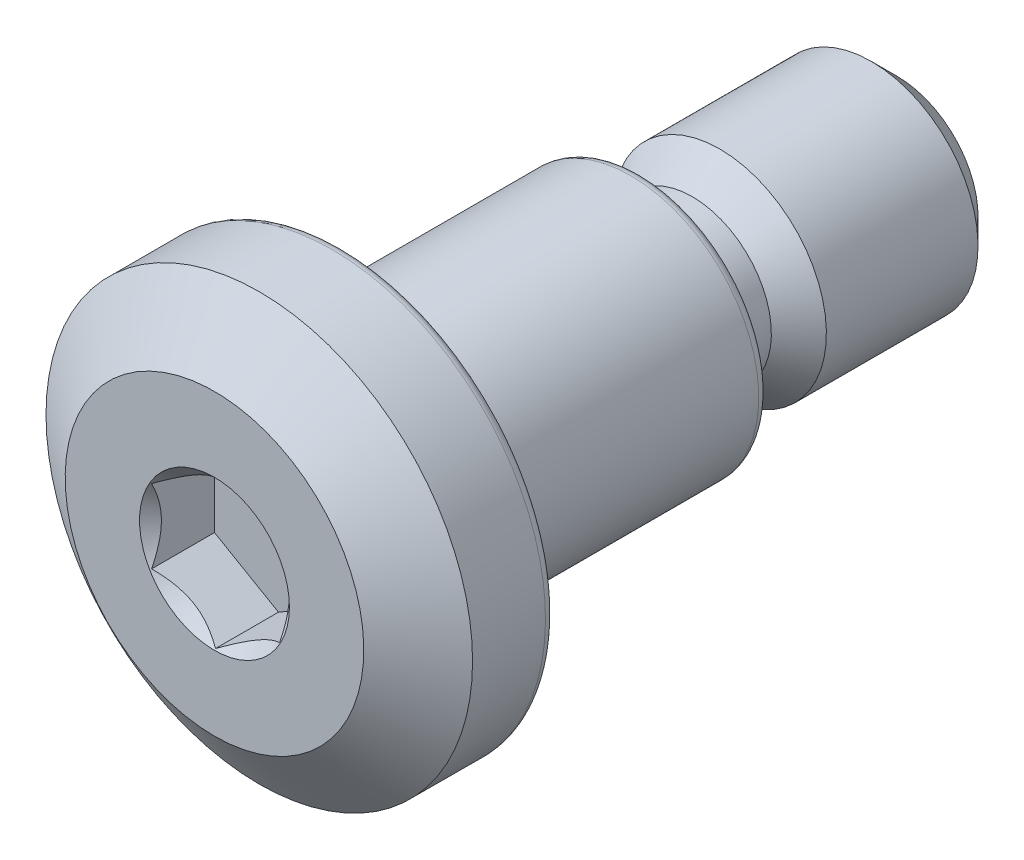
ISO-10303-21;
HEADER;
FILE_DESCRIPTION(('STEP AP214'),'2;1');
FILE_NAME('part.step','',(''),(''),'','','');
FILE_SCHEMA(('AUTOMOTIVE_DESIGN { 1 0 10303 214 1 1 1 1 }'));
ENDSEC;
DATA;
#1=APPLICATION_CONTEXT('core data for automotive mechanical design processes');
#2=APPLICATION_PROTOCOL_DEFINITION('international standard','automotive_design',2000,#1);
#3=PRODUCT_CONTEXT('',#1,'mechanical');
#4=PRODUCT('Part','Part','',(#3));
#5=PRODUCT_RELATED_PRODUCT_CATEGORY('part','',(#4));
#6=PRODUCT_DEFINITION_FORMATION('','',#4);
#7=PRODUCT_DEFINITION_CONTEXT('part definition',#1,'design');
#8=PRODUCT_DEFINITION('design','',#6,#7);
#9=PRODUCT_DEFINITION_SHAPE('','',#8);
#10=(LENGTH_UNIT() NAMED_UNIT(*) SI_UNIT(.MILLI.,.METRE.));
#11=(NAMED_UNIT(*) PLANE_ANGLE_UNIT() SI_UNIT($,.RADIAN.));
#12=(NAMED_UNIT(*) SI_UNIT($,.STERADIAN.) SOLID_ANGLE_UNIT());
#13=UNCERTAINTY_MEASURE_WITH_UNIT(LENGTH_MEASURE(1.E-05),#10,'distance_accuracy_value','');
#14=(GEOMETRIC_REPRESENTATION_CONTEXT(3) GLOBAL_UNCERTAINTY_ASSIGNED_CONTEXT((#13)) GLOBAL_UNIT_ASSIGNED_CONTEXT((#10,
#11,#12)) REPRESENTATION_CONTEXT('',''));
#15=CARTESIAN_POINT('',(0.,0.,0.));
#16=DIRECTION('',(0.,0.,1.));
#17=DIRECTION('',(1.,0.,0.));
#18=AXIS2_PLACEMENT_3D('',#15,#16,#17);
#19=CARTESIAN_POINT('',(0.,0.,-16.));
#20=DIRECTION('',(0.,0.,-1.));
#21=DIRECTION('',(0.,1.,0.));
#22=AXIS2_PLACEMENT_3D('',#19,#20,#21);
#23=CYLINDRICAL_SURFACE('',#22,3.);
#24=CARTESIAN_POINT('',(0.,0.,-3.48541019662497));
#25=DIRECTION('',(0.,0.,1.));
#26=DIRECTION('',(0.,-1.,0.));
#27=AXIS2_PLACEMENT_3D('',#24,#25,#26);
#28=CIRCLE('',#27,3.);
#29=CARTESIAN_POINT('',(0.,-3.,-3.48541019662497));
#30=VERTEX_POINT('',#29);
#31=EDGE_CURVE('E43',#30,#30,#28,.F.);
#32=ORIENTED_EDGE('',*,*,#31,.T.);
#33=EDGE_LOOP('',(#32));
#34=FACE_BOUND('',#33,.T.);
#35=CARTESIAN_POINT('',(0.,0.,-9.76000000000001));
#36=DIRECTION('',(0.,0.,-1.));
#37=DIRECTION('',(0.,1.,0.));
#38=AXIS2_PLACEMENT_3D('',#35,#36,#37);
#39=CIRCLE('',#38,3.);
#40=CARTESIAN_POINT('',(0.,3.,-9.76000000000001));
#41=VERTEX_POINT('',#40);
#42=EDGE_CURVE('E144',#41,#41,#39,.F.);
#43=ORIENTED_EDGE('',*,*,#42,.T.);
#44=EDGE_LOOP('',(#43));
#45=FACE_BOUND('',#44,.T.);
#46=ADVANCED_FACE('F35',(#34,#45),#23,.T.);
#47=CARTESIAN_POINT('',(0.,3.,-10.));
#48=DIRECTION('',(0.,0.,-1.));
#49=DIRECTION('',(0.,1.,0.));
#50=AXIS2_PLACEMENT_3D('',#47,#48,#49);
#51=PLANE('',#50);
#52=CARTESIAN_POINT('',(0.,0.,-10.));
#53=DIRECTION('',(0.,0.,-1.));
#54=DIRECTION('',(0.,1.,0.));
#55=AXIS2_PLACEMENT_3D('',#52,#53,#54);
#56=CIRCLE('',#55,2.76);
#57=CARTESIAN_POINT('',(0.,2.76,-10.));
#58=VERTEX_POINT('',#57);
#59=EDGE_CURVE('E141',#58,#58,#56,.T.);
#60=ORIENTED_EDGE('',*,*,#59,.T.);
#61=EDGE_LOOP('',(#60));
#62=FACE_BOUND('',#61,.T.);
#63=CARTESIAN_POINT('',(0.,0.,-10.));
#64=DIRECTION('',(0.,0.,-1.));
#65=DIRECTION('',(0.,1.,0.));
#66=AXIS2_PLACEMENT_3D('',#63,#64,#65);
#67=CIRCLE('',#66,2.50000000000001);
#68=CARTESIAN_POINT('',(0.,2.5,-10.));
#69=VERTEX_POINT('',#68);
#70=EDGE_CURVE('E123',#69,#69,#67,.T.);
#71=ORIENTED_EDGE('',*,*,#70,.F.);
#72=EDGE_LOOP('',(#71));
#73=FACE_BOUND('',#72,.T.);
#74=ADVANCED_FACE('F168',(#62,#73),#51,.T.);
#75=CARTESIAN_POINT('',(0.,0.,-10.645));
#76=DIRECTION('',(0.,0.,-1.));
#77=DIRECTION('',(0.,1.,0.));
#78=AXIS2_PLACEMENT_3D('',#75,#76,#77);
#79=TOROIDAL_SURFACE('',#78,2.50000000000001,0.645);
#80=CARTESIAN_POINT('',(0.,0.,-10.645));
#81=DIRECTION('',(0.,0.,-1.));
#82=DIRECTION('',(0.,1.,0.));
#83=AXIS2_PLACEMENT_3D('',#80,#81,#82);
#84=CIRCLE('',#83,1.855);
#85=CARTESIAN_POINT('',(0.,1.855,-10.645));
#86=VERTEX_POINT('',#85);
#87=EDGE_CURVE('E120',#86,#86,#84,.T.);
#88=ORIENTED_EDGE('',*,*,#87,.F.);
#89=EDGE_LOOP('',(#88));
#90=FACE_BOUND('',#89,.T.);
#91=ORIENTED_EDGE('',*,*,#70,.T.);
#92=EDGE_LOOP('',(#91));
#93=FACE_BOUND('',#92,.T.);
#94=ADVANCED_FACE('F173',(#90,#93),#79,.F.);
#95=CARTESIAN_POINT('',(0.,0.,-16.));
#96=DIRECTION('',(0.,0.,-1.));
#97=DIRECTION('',(0.,1.,0.));
#98=AXIS2_PLACEMENT_3D('',#95,#96,#97);
#99=CYLINDRICAL_SURFACE('',#98,1.855);
#100=CARTESIAN_POINT('',(0.,0.,-11.2));
#101=DIRECTION('',(0.,0.,-1.));
#102=DIRECTION('',(0.,1.,0.));
#103=AXIS2_PLACEMENT_3D('',#100,#101,#102);
#104=CIRCLE('',#103,1.855);
#105=CARTESIAN_POINT('',(0.,1.855,-11.2));
#106=VERTEX_POINT('',#105);
#107=EDGE_CURVE('E117',#106,#106,#104,.T.);
#108=ORIENTED_EDGE('',*,*,#107,.F.);
#109=EDGE_LOOP('',(#108));
#110=FACE_BOUND('',#109,.T.);
#111=ORIENTED_EDGE('',*,*,#87,.T.);
#112=EDGE_LOOP('',(#111));
#113=FACE_BOUND('',#112,.T.);
#114=ADVANCED_FACE('F342',(#110,#113),#99,.T.);
#115=CARTESIAN_POINT('',(0.,0.,-11.2));
#116=DIRECTION('',(0.,0.,-1.));
#117=DIRECTION('',(0.,1.,0.));
#118=AXIS2_PLACEMENT_3D('',#115,#116,#117);
#119=CONICAL_SURFACE('',#118,1.855,0.785398163397443);
#120=CARTESIAN_POINT('',(0.,0.,-11.845));
#121=DIRECTION('',(0.,0.,-1.));
#122=DIRECTION('',(0.,1.,0.));
#123=AXIS2_PLACEMENT_3D('',#120,#121,#122);
#124=CIRCLE('',#123,2.50000000000001);
#125=CARTESIAN_POINT('',(0.,2.5,-11.845));
#126=VERTEX_POINT('',#125);
#127=EDGE_CURVE('E126',#126,#126,#124,.F.);
#128=ORIENTED_EDGE('',*,*,#127,.T.);
#129=EDGE_LOOP('',(#128));
#130=FACE_BOUND('',#129,.T.);
#131=ORIENTED_EDGE('',*,*,#107,.T.);
#132=EDGE_LOOP('',(#131));
#133=FACE_BOUND('',#132,.T.);
#134=ADVANCED_FACE('F333',(#130,#133),#119,.T.);
#135=CARTESIAN_POINT('',(0.,2.5,-16.));
#136=DIRECTION('',(0.,0.,-1.));
#137=DIRECTION('',(0.,1.,0.));
#138=AXIS2_PLACEMENT_3D('',#135,#136,#137);
#139=PLANE('',#138);
#140=CARTESIAN_POINT('',(0.,0.,-16.));
#141=DIRECTION('',(0.,0.,-1.));
#142=DIRECTION('',(0.,1.,0.));
#143=AXIS2_PLACEMENT_3D('',#140,#141,#142);
#144=CIRCLE('',#143,1.9);
#145=CARTESIAN_POINT('',(0.,1.9,-16.));
#146=VERTEX_POINT('',#145);
#147=EDGE_CURVE('E129',#146,#146,#144,.T.);
#148=ORIENTED_EDGE('',*,*,#147,.T.);
#149=EDGE_LOOP('',(#148));
#150=FACE_BOUND('',#149,.T.);
#151=ADVANCED_FACE('F326',(#150),#139,.T.);
#152=CARTESIAN_POINT('',(0.,0.,-16.));
#153=DIRECTION('',(0.,0.,-1.));
#154=DIRECTION('',(0.,1.,0.));
#155=AXIS2_PLACEMENT_3D('',#152,#153,#154);
#156=CYLINDRICAL_SURFACE('',#155,2.50000000000001);
#157=CARTESIAN_POINT('',(0.,0.,-15.4));
#158=DIRECTION('',(0.,0.,-1.));
#159=DIRECTION('',(0.,1.,0.));
#160=AXIS2_PLACEMENT_3D('',#157,#158,#159);
#161=CIRCLE('',#160,2.50000000000001);
#162=CARTESIAN_POINT('',(0.,2.5,-15.4));
#163=VERTEX_POINT('',#162);
#164=EDGE_CURVE('E132',#163,#163,#161,.F.);
#165=ORIENTED_EDGE('',*,*,#164,.T.);
#166=EDGE_LOOP('',(#165));
#167=FACE_BOUND('',#166,.T.);
#168=ORIENTED_EDGE('',*,*,#127,.F.);
#169=EDGE_LOOP('',(#168));
#170=FACE_BOUND('',#169,.T.);
#171=ADVANCED_FACE('F182',(#167,#170),#156,.T.);
#172=CARTESIAN_POINT('',(0.,0.,-16.));
#173=DIRECTION('',(0.,0.,1.));
#174=DIRECTION('',(0.,-1.,0.));
#175=AXIS2_PLACEMENT_3D('',#172,#173,#174);
#176=CONICAL_SURFACE('',#175,1.9,0.785398163397443);
#177=ORIENTED_EDGE('',*,*,#164,.F.);
#178=EDGE_LOOP('',(#177));
#179=FACE_BOUND('',#178,.T.);
#180=ORIENTED_EDGE('',*,*,#147,.F.);
#181=EDGE_LOOP('',(#180));
#182=FACE_BOUND('',#181,.T.);
#183=ADVANCED_FACE('F178',(#179,#182),#176,.T.);
#184=CARTESIAN_POINT('',(0.,0.,-9.76000000000001));
#185=DIRECTION('',(0.,0.,-1.));
#186=DIRECTION('',(0.,1.,0.));
#187=AXIS2_PLACEMENT_3D('',#184,#185,#186);
#188=TOROIDAL_SURFACE('',#187,2.76,0.24);
#189=ORIENTED_EDGE('',*,*,#42,.F.);
#190=EDGE_LOOP('',(#189));
#191=FACE_BOUND('',#190,.T.);
#192=ORIENTED_EDGE('',*,*,#59,.F.);
#193=EDGE_LOOP('',(#192));
#194=FACE_BOUND('',#193,.T.);
#195=ADVANCED_FACE('F181',(#191,#194),#188,.T.);
#196=CARTESIAN_POINT('',(0.,0.,-3.15));
#197=DIRECTION('',(0.,0.,1.));
#198=DIRECTION('',(1.,0.,0.));
#199=AXIS2_PLACEMENT_3D('',#196,#197,#198);
#200=TOROIDAL_SURFACE('',#199,3.,0.15);
#201=CARTESIAN_POINT('',(0.,0.,-3.26180339887499));
#202=DIRECTION('',(0.,0.,1.));
#203=DIRECTION('',(0.,-1.,0.));
#204=AXIS2_PLACEMENT_3D('',#201,#202,#203);
#205=CIRCLE('',#204,2.9);
#206=CARTESIAN_POINT('',(0.,-2.9,-3.26180339887499));
#207=VERTEX_POINT('',#206);
#208=EDGE_CURVE('E11',#207,#207,#205,.T.);
#209=ORIENTED_EDGE('',*,*,#208,.T.);
#210=EDGE_LOOP('',(#209));
#211=FACE_BOUND('',#210,.T.);
#212=CARTESIAN_POINT('',(0.,0.,-3.));
#213=DIRECTION('',(0.,0.,1.));
#214=DIRECTION('',(1.,0.,0.));
#215=AXIS2_PLACEMENT_3D('',#212,#213,#214);
#216=CIRCLE('',#215,3.);
#217=CARTESIAN_POINT('',(3.,0.,-3.));
#218=VERTEX_POINT('',#217);
#219=EDGE_CURVE('E206',#218,#218,#216,.F.);
#220=ORIENTED_EDGE('',*,*,#219,.T.);
#221=EDGE_LOOP('',(#220));
#222=FACE_BOUND('',#221,.T.);
#223=ADVANCED_FACE('F191',(#211,#222),#200,.F.);
#224=CARTESIAN_POINT('',(0.,0.,-1.5));
#225=DIRECTION('',(0.,0.,1.));
#226=DIRECTION('',(1.,0.,0.));
#227=AXIS2_PLACEMENT_3D('',#224,#225,#226);
#228=PLANE('',#227);
#229=DIRECTION('',(-0.866025403784439,0.499999999999999,0.));
#230=VECTOR('',#229,1.);
#231=CARTESIAN_POINT('',(1.5,0.866025403784439,-1.5));
#232=LINE('',#231,#230);
#233=CARTESIAN_POINT('',(1.5,0.866025403784439,-1.5));
#234=VERTEX_POINT('',#233);
#235=CARTESIAN_POINT('',(0.,1.73205080756888,-1.5));
#236=VERTEX_POINT('',#235);
#237=EDGE_CURVE('E100',#234,#236,#232,.T.);
#238=ORIENTED_EDGE('',*,*,#237,.T.);
#239=DIRECTION('',(-0.866025403784438,-0.500000000000001,0.));
#240=VECTOR('',#239,1.);
#241=CARTESIAN_POINT('',(0.,1.73205080756888,-1.5));
#242=LINE('',#241,#240);
#243=CARTESIAN_POINT('',(-1.5,0.866025403784438,-1.5));
#244=VERTEX_POINT('',#243);
#245=EDGE_CURVE('E105',#236,#244,#242,.T.);
#246=ORIENTED_EDGE('',*,*,#245,.T.);
#247=DIRECTION('',(0.,-1.,0.));
#248=VECTOR('',#247,1.);
#249=CARTESIAN_POINT('',(-1.5,0.866025403784438,-1.5));
#250=LINE('',#249,#248);
#251=CARTESIAN_POINT('',(-1.5,-0.866025403784438,-1.5));
#252=VERTEX_POINT('',#251);
#253=EDGE_CURVE('E282',#244,#252,#250,.T.);
#254=ORIENTED_EDGE('',*,*,#253,.T.);
#255=DIRECTION('',(0.866025403784439,-0.5,0.));
#256=VECTOR('',#255,1.);
#257=CARTESIAN_POINT('',(-1.5,-0.866025403784438,-1.5));
#258=LINE('',#257,#256);
#259=CARTESIAN_POINT('',(0.,-1.73205080756888,-1.5));
#260=VERTEX_POINT('',#259);
#261=EDGE_CURVE('E286',#252,#260,#258,.T.);
#262=ORIENTED_EDGE('',*,*,#261,.T.);
#263=DIRECTION('',(0.866025403784438,0.5,0.));
#264=VECTOR('',#263,1.);
#265=CARTESIAN_POINT('',(0.,-1.73205080756888,-1.5));
#266=LINE('',#265,#264);
#267=CARTESIAN_POINT('',(1.5,-0.866025403784438,-1.5));
#268=VERTEX_POINT('',#267);
#269=EDGE_CURVE('E113',#260,#268,#266,.T.);
#270=ORIENTED_EDGE('',*,*,#269,.T.);
#271=DIRECTION('',(0.,1.,0.));
#272=VECTOR('',#271,1.);
#273=CARTESIAN_POINT('',(1.5,-0.866025403784438,-1.5));
#274=LINE('',#273,#272);
#275=EDGE_CURVE('E108',#268,#234,#274,.T.);
#276=ORIENTED_EDGE('',*,*,#275,.T.);
#277=EDGE_LOOP('',(#238,#246,#254,#262,#270,#276));
#278=FACE_BOUND('',#277,.T.);
#279=ADVANCED_FACE('F232',(#278),#228,.T.);
#280=CARTESIAN_POINT('',(1.5,0.866025403784439,-1.5));
#281=DIRECTION('',(0.499999999999999,0.866025403784439,0.));
#282=DIRECTION('',(-0.866025403784439,0.499999999999999,0.));
#283=AXIS2_PLACEMENT_3D('',#280,#281,#282);
#284=PLANE('',#283);
#285=DIRECTION('',(0.,0.,1.));
#286=VECTOR('',#285,1.);
#287=CARTESIAN_POINT('',(1.5,0.866025403784439,-1.5));
#288=LINE('',#287,#286);
#289=CARTESIAN_POINT('',(1.5,0.86602540378444,-0.0250000000000002));
#290=VERTEX_POINT('',#289);
#291=EDGE_CURVE('E58',#234,#290,#288,.T.);
#292=ORIENTED_EDGE('',*,*,#291,.T.);
#293=CARTESIAN_POINT('',(1.5002,0.865909933730602,-0.0248845183999266));
#294=CARTESIAN_POINT('',(1.44863220926292,0.895682611594167,-0.0546345239326721));
#295=CARTESIAN_POINT('',(1.3962020823348,0.925953159489766,-0.0826375160896872));
#296=CARTESIAN_POINT('',(1.2892909659444,0.987678321317124,-0.133910769559857));
#297=CARTESIAN_POINT('',(1.23479980418534,1.01913880822718,-0.157152494955627));
#298=CARTESIAN_POINT('',(1.12492091864275,1.08257741237344,-0.19696627100778));
#299=CARTESIAN_POINT('',(1.0695611909048,1.11453936608521,-0.213638414329104));
#300=CARTESIAN_POINT('',(0.957622742522848,1.1791670593912,-0.239325543181897));
#301=CARTESIAN_POINT('',(0.90104744344699,1.21183082354213,-0.248359709521134));
#302=CARTESIAN_POINT('',(0.803544610483558,1.26812411040032,-0.256510918773148));
#303=CARTESIAN_POINT('',(0.762743091719533,1.29168087824208,-0.257717747010784));
#304=CARTESIAN_POINT('',(0.681212030384141,1.33875285845138,-0.255685942837733));
#305=CARTESIAN_POINT('',(0.640482505685369,1.36226806050018,-0.252446329251693));
#306=CARTESIAN_POINT('',(0.559415597836583,1.40907206156905,-0.241708014018038));
#307=CARTESIAN_POINT('',(0.519078615401711,1.43236062923612,-0.234205346981267));
#308=CARTESIAN_POINT('',(0.439081663085968,1.47854689118996,-0.21534838807171));
#309=CARTESIAN_POINT('',(0.399421991483791,1.50144441326545,-0.203992442981415));
#310=CARTESIAN_POINT('',(0.297836865225514,1.56009461325633,-0.170278352407329));
#311=CARTESIAN_POINT('',(0.236541446290309,1.59548353987866,-0.145378150906633));
#312=CARTESIAN_POINT('',(0.146414371536685,1.64751843074894,-0.103343346728424));
#313=CARTESIAN_POINT('',(0.116714860092281,1.66466545167617,-0.088574846440904));
#314=CARTESIAN_POINT('',(0.0578620986162473,1.69864410935691,-0.0576894340598313));
#315=CARTESIAN_POINT('',(0.028708595779361,1.71547589206761,-0.0415731658782895));
#316=CARTESIAN_POINT('',(-0.000200000000001772,1.73216627762271,-0.0248845183999265));
#317=B_SPLINE_CURVE_WITH_KNOTS('',3,(#293,#294,#295,#296,#297,#298,#299,#300,#301,#302,#303,
#304,#305,#306,#307,#308,#309,#310,#311,#312,#313,#314,#315,#316),.UNSPECIFIED.,.F.,.F.,(4,2,2,
2,2,2,2,2,2,2,2,4),(0.,0.199829143693304,0.400822987382389,0.598623720538181,0.795926240188889,
0.937113067959881,1.07833105577193,1.21968061668222,1.36109089931054,1.58570969637565,
1.69770705470964,1.80965120737194),.UNSPECIFIED.);
#318=CARTESIAN_POINT('',(0.,1.73205080756888,-0.025));
#319=VERTEX_POINT('',#318);
#320=EDGE_CURVE('E90',#290,#319,#317,.T.);
#321=ORIENTED_EDGE('',*,*,#320,.T.);
#322=DIRECTION('',(0.,0.,1.));
#323=VECTOR('',#322,1.);
#324=CARTESIAN_POINT('',(0.,1.73205080756888,-1.5));
#325=LINE('',#324,#323);
#326=EDGE_CURVE('E98',#236,#319,#325,.T.);
#327=ORIENTED_EDGE('',*,*,#326,.F.);
#328=ORIENTED_EDGE('',*,*,#237,.F.);
#329=EDGE_LOOP('',(#292,#321,#327,#328));
#330=FACE_BOUND('',#329,.T.);
#331=ADVANCED_FACE('F97',(#330),#284,.F.);
#332=CARTESIAN_POINT('',(0.,1.73205080756888,-1.5));
#333=DIRECTION('',(-0.5,0.866025403784438,0.));
#334=DIRECTION('',(-0.866025403784438,-0.500000000000001,0.));
#335=AXIS2_PLACEMENT_3D('',#332,#333,#334);
#336=PLANE('',#335);
#337=ORIENTED_EDGE('',*,*,#326,.T.);
#338=CARTESIAN_POINT('',(0.000199999999998206,1.73216627762271,-0.0248845183999265));
#339=CARTESIAN_POINT('',(-0.0513677907370776,1.70239359975915,-0.0546345239326721));
#340=CARTESIAN_POINT('',(-0.103797917665203,1.67212305186355,-0.0826375160896872));
#341=CARTESIAN_POINT('',(-0.210709034055598,1.61039789003619,-0.133910769559857));
#342=CARTESIAN_POINT('',(-0.265200195814663,1.57893740312614,-0.157152494955627));
#343=CARTESIAN_POINT('',(-0.37507908135725,1.51549879897987,-0.19696627100778));
#344=CARTESIAN_POINT('',(-0.430438809095201,1.4835368452681,-0.213638414329103));
#345=CARTESIAN_POINT('',(-0.542377257477152,1.41890915196211,-0.239325543181896));
#346=CARTESIAN_POINT('',(-0.59895255655301,1.38624538781118,-0.248359709521134));
#347=CARTESIAN_POINT('',(-0.696455389516442,1.32995210095299,-0.256510918773147));
#348=CARTESIAN_POINT('',(-0.737256908280467,1.30639533311124,-0.257717747010783));
#349=CARTESIAN_POINT('',(-0.818787969615859,1.25932335290193,-0.255685942837732));
#350=CARTESIAN_POINT('',(-0.859517494314631,1.23580815085313,-0.252446329251692));
#351=CARTESIAN_POINT('',(-0.940584402163417,1.18900414978427,-0.241708014018038));
#352=CARTESIAN_POINT('',(-0.980921384598289,1.16571558211719,-0.234205346981267));
#353=CARTESIAN_POINT('',(-1.06091833691403,1.11952932016335,-0.215348388071709));
#354=CARTESIAN_POINT('',(-1.10057800851621,1.09663179808786,-0.203992442981415));
#355=CARTESIAN_POINT('',(-1.20216313477449,1.03798159809698,-0.170278352407328));
#356=CARTESIAN_POINT('',(-1.26345855370969,1.00259267147465,-0.145378150906633));
#357=CARTESIAN_POINT('',(-1.35358562846331,0.950557780604374,-0.103343346728423));
#358=CARTESIAN_POINT('',(-1.38328513990772,0.933410759677147,-0.0885748464409035));
#359=CARTESIAN_POINT('',(-1.44213790138375,0.899432101996406,-0.0576894340598308));
#360=CARTESIAN_POINT('',(-1.47129140422064,0.882600319285709,-0.041573165878289));
#361=CARTESIAN_POINT('',(-1.5002,0.8659099337306,-0.024884518399926));
#362=B_SPLINE_CURVE_WITH_KNOTS('',3,(#338,#339,#340,#341,#342,#343,#344,#345,#346,#347,#348,
#349,#350,#351,#352,#353,#354,#355,#356,#357,#358,#359,#360,#361),.UNSPECIFIED.,.F.,.F.,(4,2,2,
2,2,2,2,2,2,2,2,4),(0.,0.199829143693305,0.400822987382388,0.59862372053818,0.795926240188888,
0.93711306795988,1.07833105577193,1.21968061668222,1.36109089931054,1.58570969637565,
1.69770705470964,1.80965120737194),.UNSPECIFIED.);
#363=CARTESIAN_POINT('',(-1.5,0.866025403784438,-0.0249999999999995));
#364=VERTEX_POINT('',#363);
#365=EDGE_CURVE('E87',#319,#364,#362,.T.);
#366=ORIENTED_EDGE('',*,*,#365,.T.);
#367=DIRECTION('',(0.,0.,1.));
#368=VECTOR('',#367,1.);
#369=CARTESIAN_POINT('',(-1.5,0.866025403784438,-1.5));
#370=LINE('',#369,#368);
#371=EDGE_CURVE('E107',#244,#364,#370,.T.);
#372=ORIENTED_EDGE('',*,*,#371,.F.);
#373=ORIENTED_EDGE('',*,*,#245,.F.);
#374=EDGE_LOOP('',(#337,#366,#372,#373));
#375=FACE_BOUND('',#374,.T.);
#376=ADVANCED_FACE('F103',(#375),#336,.F.);
#377=CARTESIAN_POINT('',(-1.5,0.866025403784438,-1.5));
#378=DIRECTION('',(-1.,0.,0.));
#379=DIRECTION('',(0.,-1.,0.));
#380=AXIS2_PLACEMENT_3D('',#377,#378,#379);
#381=PLANE('',#380);
#382=ORIENTED_EDGE('',*,*,#371,.T.);
#383=CARTESIAN_POINT('',(-1.5,-1.77001977701837,0.563072036384898));
#384=CARTESIAN_POINT('',(-1.5,-1.72710856600161,0.530340037813163));
#385=CARTESIAN_POINT('',(-1.5,-1.68396298244538,0.497916220868796));
#386=CARTESIAN_POINT('',(-1.5,-1.59710634399691,0.433813460996927));
#387=CARTESIAN_POINT('',(-1.5,-1.55339515415669,0.402134701108771));
#388=CARTESIAN_POINT('',(-1.5,-1.42062837654603,0.307956537821956));
#389=CARTESIAN_POINT('',(-1.5,-1.33059104324195,0.246818502732742));
#390=CARTESIAN_POINT('',(-1.5,-1.14150477437901,0.126397253622331));
#391=CARTESIAN_POINT('',(-1.5,-1.04224002828846,0.0674492094307904));
#392=CARTESIAN_POINT('',(-1.5,-0.838699253217519,-0.0406565204452409));
#393=CARTESIAN_POINT('',(-1.5,-0.734441679243553,-0.0898472558367985));
#394=CARTESIAN_POINT('',(-1.5,-0.578354560203821,-0.15003989756235));
#395=CARTESIAN_POINT('',(-1.5,-0.528927298322973,-0.167241706474152));
#396=CARTESIAN_POINT('',(-1.5,-0.428842070162196,-0.197681895110384));
#397=CARTESIAN_POINT('',(-1.5,-0.378184022922165,-0.210920013339033));
#398=CARTESIAN_POINT('',(-1.5,-0.276807413519617,-0.232511841094974));
#399=CARTESIAN_POINT('',(-1.5,-0.226107543097736,-0.240951912173045));
#400=CARTESIAN_POINT('',(-1.5,-0.124118225197727,-0.252775870546917));
#401=CARTESIAN_POINT('',(-1.5,-0.0728288918158567,-0.256160720257421));
#402=CARTESIAN_POINT('',(-1.5,0.0277665696347319,-0.257603172153171));
#403=CARTESIAN_POINT('',(-1.5,0.0770697663048973,-0.25586891651592));
#404=CARTESIAN_POINT('',(-1.5,0.175274226674316,-0.24763848974604));
#405=CARTESIAN_POINT('',(-1.5,0.224175452194968,-0.241141871457276));
#406=CARTESIAN_POINT('',(-1.5,0.322050721926156,-0.22363814530672));
#407=CARTESIAN_POINT('',(-1.5,0.371010545251796,-0.212552749645115));
#408=CARTESIAN_POINT('',(-1.5,0.467854574539853,-0.186473475113712));
#409=CARTESIAN_POINT('',(-1.5,0.51573885499982,-0.17147986785887));
#410=CARTESIAN_POINT('',(-1.5,0.664602845365928,-0.119175899647653));
#411=CARTESIAN_POINT('',(-1.5,0.763511941152207,-0.0759884314706544));
#412=CARTESIAN_POINT('',(-1.5,0.956699477249698,0.0200839049948803));
#413=CARTESIAN_POINT('',(-1.5,1.05095990148586,0.0730032363636189));
#414=CARTESIAN_POINT('',(-1.5,1.23113015464446,0.182234555198714));
#415=CARTESIAN_POINT('',(-1.5,1.31722242588035,0.238249377607113));
#416=CARTESIAN_POINT('',(-1.5,1.4440614337001,0.324865969306155));
#417=CARTESIAN_POINT('',(-1.5,1.48579470634733,0.354048156198746));
#418=CARTESIAN_POINT('',(-1.5,1.56868960962715,0.413190489951721));
#419=CARTESIAN_POINT('',(-1.5,1.60985139454399,0.443150420320662));
#420=CARTESIAN_POINT('',(-1.5,1.65077501970286,0.473433033590922));
#421=B_SPLINE_CURVE_WITH_KNOTS('',3,(#383,#384,#385,#386,#387,#388,#389,#390,#391,#392,#393,
#394,#395,#396,#397,#398,#399,#400,#401,#402,#403,#404,#405,#406,#407,#408,#409,#410,#411,#412,
#413,#414,#415,#416,#417,#418,#419,#420),.UNSPECIFIED.,.F.,.F.,(4,2,2,2,2,2,2,2,2,2,2,2,2,2,2,2,
2,2,4),(0.,0.161905864308372,0.323851097362234,0.650209764977349,0.99628393253061,
1.34116508098443,1.49803838916067,1.65492204442942,1.80888439833409,1.96281743709717,
2.11057890507622,2.25835424871241,2.40876204734194,2.55915939563656,2.88199378839328,
3.20599424240407,3.51397308277047,3.66673951461235,3.81946386920359),.UNSPECIFIED.);
#422=CARTESIAN_POINT('',(-1.5,-0.866025403784438,-0.0249999999999999));
#423=VERTEX_POINT('',#422);
#424=EDGE_CURVE('E50',#364,#423,#421,.F.);
#425=ORIENTED_EDGE('',*,*,#424,.T.);
#426=DIRECTION('',(0.,0.,1.));
#427=VECTOR('',#426,1.);
#428=CARTESIAN_POINT('',(-1.5,-0.866025403784438,-1.5));
#429=LINE('',#428,#427);
#430=EDGE_CURVE('E110',#252,#423,#429,.T.);
#431=ORIENTED_EDGE('',*,*,#430,.F.);
#432=ORIENTED_EDGE('',*,*,#253,.F.);
#433=EDGE_LOOP('',(#382,#425,#431,#432));
#434=FACE_BOUND('',#433,.T.);
#435=ADVANCED_FACE('F271',(#434),#381,.F.);
#436=CARTESIAN_POINT('',(-1.5,-0.866025403784438,-1.5));
#437=DIRECTION('',(-0.5,-0.866025403784439,0.));
#438=DIRECTION('',(0.866025403784439,-0.5,0.));
#439=AXIS2_PLACEMENT_3D('',#436,#437,#438);
#440=PLANE('',#439);
#441=ORIENTED_EDGE('',*,*,#430,.T.);
#442=CARTESIAN_POINT('',(-1.5002,-0.8659099337306,-0.0248845183999264));
#443=CARTESIAN_POINT('',(-1.44863220926292,-0.895682611594165,-0.054634523932672));
#444=CARTESIAN_POINT('',(-1.3962020823348,-0.925953159489764,-0.0826375160896872));
#445=CARTESIAN_POINT('',(-1.2892909659444,-0.987678321317123,-0.133910769559857));
#446=CARTESIAN_POINT('',(-1.23479980418534,-1.01913880822717,-0.157152494955627));
#447=CARTESIAN_POINT('',(-1.12492091864275,-1.08257741237344,-0.19696627100778));
#448=CARTESIAN_POINT('',(-1.0695611909048,-1.11453936608521,-0.213638414329104));
#449=CARTESIAN_POINT('',(-0.957622742522849,-1.1791670593912,-0.239325543181897));
#450=CARTESIAN_POINT('',(-0.901047443446991,-1.21183082354213,-0.248359709521135));
#451=CARTESIAN_POINT('',(-0.803544610483558,-1.26812411040032,-0.256510918773149));
#452=CARTESIAN_POINT('',(-0.762743091719533,-1.29168087824208,-0.257717747010784));
#453=CARTESIAN_POINT('',(-0.681212030384141,-1.33875285845138,-0.255685942837733));
#454=CARTESIAN_POINT('',(-0.640482505685369,-1.36226806050018,-0.252446329251693));
#455=CARTESIAN_POINT('',(-0.559415597836583,-1.40907206156905,-0.241708014018039));
#456=CARTESIAN_POINT('',(-0.519078615401711,-1.43236062923612,-0.234205346981268));
#457=CARTESIAN_POINT('',(-0.439081663085968,-1.47854689118996,-0.21534838807171));
#458=CARTESIAN_POINT('',(-0.399421991483791,-1.50144441326545,-0.203992442981416));
#459=CARTESIAN_POINT('',(-0.297836865225514,-1.56009461325633,-0.170278352407329));
#460=CARTESIAN_POINT('',(-0.23654144629031,-1.59548353987866,-0.145378150906633));
#461=CARTESIAN_POINT('',(-0.146414371536685,-1.64751843074894,-0.103343346728424));
#462=CARTESIAN_POINT('',(-0.116714860092281,-1.66466545167617,-0.0885748464409044));
#463=CARTESIAN_POINT('',(-0.057862098616248,-1.69864410935691,-0.0576894340598319));
#464=CARTESIAN_POINT('',(-0.0287085957793618,-1.71547589206761,-0.0415731658782901));
#465=CARTESIAN_POINT('',(0.000200000000000909,-1.73216627762271,-0.0248845183999269));
#466=B_SPLINE_CURVE_WITH_KNOTS('',3,(#442,#443,#444,#445,#446,#447,#448,#449,#450,#451,#452,
#453,#454,#455,#456,#457,#458,#459,#460,#461,#462,#463,#464,#465),.UNSPECIFIED.,.F.,.F.,(4,2,2,
2,2,2,2,2,2,2,2,4),(0.,0.199829143693305,0.40082298738239,0.598623720538182,0.795926240188891,
0.937113067959882,1.07833105577193,1.21968061668222,1.36109089931055,1.58570969637566,
1.69770705470964,1.80965120737194),.UNSPECIFIED.);
#467=CARTESIAN_POINT('',(0.,-1.73205080756888,-0.0250000000000006));
#468=VERTEX_POINT('',#467);
#469=EDGE_CURVE('E239',#423,#468,#466,.T.);
#470=ORIENTED_EDGE('',*,*,#469,.T.);
#471=DIRECTION('',(0.,0.,1.));
#472=VECTOR('',#471,1.);
#473=CARTESIAN_POINT('',(0.,-1.73205080756888,-1.5));
#474=LINE('',#473,#472);
#475=EDGE_CURVE('E297',#260,#468,#474,.T.);
#476=ORIENTED_EDGE('',*,*,#475,.F.);
#477=ORIENTED_EDGE('',*,*,#261,.F.);
#478=EDGE_LOOP('',(#441,#470,#476,#477));
#479=FACE_BOUND('',#478,.T.);
#480=ADVANCED_FACE('F267',(#479),#440,.F.);
#481=CARTESIAN_POINT('',(0.,-1.73205080756888,-1.5));
#482=DIRECTION('',(0.5,-0.866025403784438,0.));
#483=DIRECTION('',(0.866025403784438,0.5,0.));
#484=AXIS2_PLACEMENT_3D('',#481,#482,#483);
#485=PLANE('',#484);
#486=ORIENTED_EDGE('',*,*,#475,.T.);
#487=CARTESIAN_POINT('',(-0.000199999999999155,-1.73216627762271,-0.0248845183999272));
#488=CARTESIAN_POINT('',(0.0513677907370766,-1.70239359975915,-0.0546345239326727));
#489=CARTESIAN_POINT('',(0.103797917665202,-1.67212305186355,-0.0826375160896878));
#490=CARTESIAN_POINT('',(0.210709034055597,-1.61039789003619,-0.133910769559858));
#491=CARTESIAN_POINT('',(0.265200195814662,-1.57893740312614,-0.157152494955628));
#492=CARTESIAN_POINT('',(0.375079081357249,-1.51549879897987,-0.196966271007781));
#493=CARTESIAN_POINT('',(0.4304388090952,-1.4835368452681,-0.213638414329104));
#494=CARTESIAN_POINT('',(0.542377257477151,-1.41890915196211,-0.239325543181897));
#495=CARTESIAN_POINT('',(0.598952556553009,-1.38624538781118,-0.248359709521135));
#496=CARTESIAN_POINT('',(0.696455389516441,-1.32995210095299,-0.256510918773148));
#497=CARTESIAN_POINT('',(0.737256908280467,-1.30639533311124,-0.257717747010784));
#498=CARTESIAN_POINT('',(0.818787969615858,-1.25932335290193,-0.255685942837733));
#499=CARTESIAN_POINT('',(0.85951749431463,-1.23580815085313,-0.252446329251693));
#500=CARTESIAN_POINT('',(0.940584402163416,-1.18900414978426,-0.241708014018039));
#501=CARTESIAN_POINT('',(0.980921384598288,-1.16571558211719,-0.234205346981267));
#502=CARTESIAN_POINT('',(1.06091833691403,-1.11952932016335,-0.21534838807171));
#503=CARTESIAN_POINT('',(1.10057800851621,-1.09663179808786,-0.203992442981416));
#504=CARTESIAN_POINT('',(1.20216313477448,-1.03798159809698,-0.170278352407329));
#505=CARTESIAN_POINT('',(1.26345855370969,-1.00259267147465,-0.145378150906634));
#506=CARTESIAN_POINT('',(1.35358562846331,-0.950557780604374,-0.103343346728424));
#507=CARTESIAN_POINT('',(1.38328513990772,-0.933410759677146,-0.0885748464409046));
#508=CARTESIAN_POINT('',(1.44213790138375,-0.899432101996406,-0.0576894340598321));
#509=CARTESIAN_POINT('',(1.47129140422064,-0.882600319285709,-0.0415731658782904));
#510=CARTESIAN_POINT('',(1.5002,-0.8659099337306,-0.0248845183999273));
#511=B_SPLINE_CURVE_WITH_KNOTS('',3,(#487,#488,#489,#490,#491,#492,#493,#494,#495,#496,#497,
#498,#499,#500,#501,#502,#503,#504,#505,#506,#507,#508,#509,#510),.UNSPECIFIED.,.F.,.F.,(4,2,2,
2,2,2,2,2,2,2,2,4),(0.,0.199829143693305,0.400822987382389,0.598623720538181,0.795926240188889,
0.937113067959881,1.07833105577193,1.21968061668222,1.36109089931054,1.58570969637565,
1.69770705470963,1.80965120737194),.UNSPECIFIED.);
#512=CARTESIAN_POINT('',(1.5,-0.866025403784438,-0.0250000000000009));
#513=VERTEX_POINT('',#512);
#514=EDGE_CURVE('E246',#468,#513,#511,.T.);
#515=ORIENTED_EDGE('',*,*,#514,.T.);
#516=DIRECTION('',(0.,0.,1.));
#517=VECTOR('',#516,1.);
#518=CARTESIAN_POINT('',(1.5,-0.866025403784438,-1.5));
#519=LINE('',#518,#517);
#520=EDGE_CURVE('E294',#268,#513,#519,.T.);
#521=ORIENTED_EDGE('',*,*,#520,.F.);
#522=ORIENTED_EDGE('',*,*,#269,.F.);
#523=EDGE_LOOP('',(#486,#515,#521,#522));
#524=FACE_BOUND('',#523,.T.);
#525=ADVANCED_FACE('F264',(#524),#485,.F.);
#526=CARTESIAN_POINT('',(1.5,-0.866025403784438,-1.5));
#527=DIRECTION('',(1.,0.,0.));
#528=DIRECTION('',(0.,0.,-1.));
#529=AXIS2_PLACEMENT_3D('',#526,#527,#528);
#530=PLANE('',#529);
#531=ORIENTED_EDGE('',*,*,#520,.T.);
#532=CARTESIAN_POINT('',(1.5,-1.77001977701837,0.563072036384898));
#533=CARTESIAN_POINT('',(1.5,-1.72710856600161,0.530340037813163));
#534=CARTESIAN_POINT('',(1.5,-1.68396298244538,0.497916220868796));
#535=CARTESIAN_POINT('',(1.5,-1.59710634399691,0.433813460996927));
#536=CARTESIAN_POINT('',(1.5,-1.55339515415669,0.40213470110877));
#537=CARTESIAN_POINT('',(1.5,-1.42062837654603,0.307956537821955));
#538=CARTESIAN_POINT('',(1.5,-1.33059104324196,0.246818502732741));
#539=CARTESIAN_POINT('',(1.5,-1.14150477437901,0.126397253622331));
#540=CARTESIAN_POINT('',(1.5,-1.04224002828846,0.0674492094307897));
#541=CARTESIAN_POINT('',(1.5,-0.838699253217519,-0.0406565204452416));
#542=CARTESIAN_POINT('',(1.5,-0.734441679243553,-0.0898472558367992));
#543=CARTESIAN_POINT('',(1.5,-0.578354560203822,-0.150039897562351));
#544=CARTESIAN_POINT('',(1.5,-0.528927298322973,-0.167241706474152));
#545=CARTESIAN_POINT('',(1.5,-0.428842070162197,-0.197681895110385));
#546=CARTESIAN_POINT('',(1.5,-0.378184022922166,-0.210920013339034));
#547=CARTESIAN_POINT('',(1.5,-0.276807413519618,-0.232511841094975));
#548=CARTESIAN_POINT('',(1.5,-0.226107543097737,-0.240951912173046));
#549=CARTESIAN_POINT('',(1.5,-0.124118225197728,-0.252775870546919));
#550=CARTESIAN_POINT('',(1.5,-0.0728288918158572,-0.256160720257423));
#551=CARTESIAN_POINT('',(1.5,0.0277665696347314,-0.257603172153173));
#552=CARTESIAN_POINT('',(1.5,0.0770697663048967,-0.255868916515921));
#553=CARTESIAN_POINT('',(1.5,0.175274226674316,-0.247638489746041));
#554=CARTESIAN_POINT('',(1.5,0.224175452194967,-0.241141871457277));
#555=CARTESIAN_POINT('',(1.5,0.322050721926155,-0.223638145306722));
#556=CARTESIAN_POINT('',(1.5,0.371010545251795,-0.212552749645116));
#557=CARTESIAN_POINT('',(1.5,0.467854574539852,-0.186473475113713));
#558=CARTESIAN_POINT('',(1.5,0.515738854999819,-0.171479867858871));
#559=CARTESIAN_POINT('',(1.5,0.664602845365927,-0.119175899647655));
#560=CARTESIAN_POINT('',(1.5,0.763511941152206,-0.0759884314706562));
#561=CARTESIAN_POINT('',(1.5,0.956699477249697,0.0200839049948785));
#562=CARTESIAN_POINT('',(1.5,1.05095990148586,0.0730032363636169));
#563=CARTESIAN_POINT('',(1.5,1.23113015464446,0.182234555198712));
#564=CARTESIAN_POINT('',(1.5,1.31722242588035,0.23824937760711));
#565=CARTESIAN_POINT('',(1.5,1.4440614337001,0.324865969306151));
#566=CARTESIAN_POINT('',(1.5,1.48579470634733,0.354048156198742));
#567=CARTESIAN_POINT('',(1.5,1.56868960962714,0.413190489951717));
#568=CARTESIAN_POINT('',(1.5,1.60985139454398,0.443150420320659));
#569=CARTESIAN_POINT('',(1.5,1.65077501970286,0.473433033590919));
#570=B_SPLINE_CURVE_WITH_KNOTS('',3,(#532,#533,#534,#535,#536,#537,#538,#539,#540,#541,#542,
#543,#544,#545,#546,#547,#548,#549,#550,#551,#552,#553,#554,#555,#556,#557,#558,#559,#560,#561,
#562,#563,#564,#565,#566,#567,#568,#569),.UNSPECIFIED.,.F.,.F.,(4,2,2,2,2,2,2,2,2,2,2,2,2,2,2,2,
2,2,4),(0.,0.161905864308372,0.323851097362234,0.650209764977349,0.99628393253061,
1.34116508098443,1.49803838916067,1.65492204442942,1.80888439833409,1.96281743709717,
2.11057890507622,2.25835424871241,2.40876204734194,2.55915939563656,2.88199378839328,
3.20599424240407,3.51397308277047,3.66673951461235,3.81946386920358),.UNSPECIFIED.);
#571=EDGE_CURVE('E101',#513,#290,#570,.T.);
#572=ORIENTED_EDGE('',*,*,#571,.T.);
#573=ORIENTED_EDGE('',*,*,#291,.F.);
#574=ORIENTED_EDGE('',*,*,#275,.F.);
#575=EDGE_LOOP('',(#531,#572,#573,#574));
#576=FACE_BOUND('',#575,.T.);
#577=ADVANCED_FACE('F230',(#576),#530,.F.);
#578=CARTESIAN_POINT('',(0.,0.,0.));
#579=DIRECTION('',(0.,0.,1.));
#580=DIRECTION('',(1.,0.,0.));
#581=AXIS2_PLACEMENT_3D('',#578,#579,#580);
#582=CONICAL_SURFACE('',#581,1.75705080756888,0.78539816339745);
#583=CARTESIAN_POINT('',(0.,0.,0.));
#584=DIRECTION('',(0.,0.,1.));
#585=DIRECTION('',(1.,0.,0.));
#586=AXIS2_PLACEMENT_3D('',#583,#584,#585);
#587=CIRCLE('',#586,1.75705080756888);
#588=CARTESIAN_POINT('',(1.75705080756888,0.,0.));
#589=VERTEX_POINT('',#588);
#590=EDGE_CURVE('E94',#589,#589,#587,.T.);
#591=ORIENTED_EDGE('',*,*,#590,.T.);
#592=EDGE_LOOP('',(#591));
#593=FACE_BOUND('',#592,.T.);
#594=ORIENTED_EDGE('',*,*,#571,.F.);
#595=ORIENTED_EDGE('',*,*,#514,.F.);
#596=ORIENTED_EDGE('',*,*,#469,.F.);
#597=ORIENTED_EDGE('',*,*,#424,.F.);
#598=ORIENTED_EDGE('',*,*,#365,.F.);
#599=ORIENTED_EDGE('',*,*,#320,.F.);
#600=EDGE_LOOP('',(#594,#595,#596,#597,#598,#599));
#601=FACE_BOUND('',#600,.T.);
#602=ADVANCED_FACE('F89',(#593,#601),#582,.F.);
#603=CARTESIAN_POINT('',(0.,0.,0.));
#604=DIRECTION('',(0.,0.,1.));
#605=DIRECTION('',(0.,-1.,0.));
#606=AXIS2_PLACEMENT_3D('',#603,#604,#605);
#607=PLANE('',#606);
#608=CARTESIAN_POINT('',(0.,0.,0.));
#609=DIRECTION('',(0.,0.,1.));
#610=DIRECTION('',(0.,-1.,0.));
#611=AXIS2_PLACEMENT_3D('',#608,#609,#610);
#612=CIRCLE('',#611,3.49999999999999);
#613=CARTESIAN_POINT('',(0.,-3.49999999999999,0.));
#614=VERTEX_POINT('',#613);
#615=EDGE_CURVE('E138',#614,#614,#612,.T.);
#616=ORIENTED_EDGE('',*,*,#615,.T.);
#617=EDGE_LOOP('',(#616));
#618=FACE_BOUND('',#617,.T.);
#619=ORIENTED_EDGE('',*,*,#590,.F.);
#620=EDGE_LOOP('',(#619));
#621=FACE_BOUND('',#620,.T.);
#622=ADVANCED_FACE('F188',(#618,#621),#607,.T.);
#623=CARTESIAN_POINT('',(0.,0.,-1.05031130731457));
#624=DIRECTION('',(0.,0.,-1.));
#625=DIRECTION('',(0.,1.,0.));
#626=AXIS2_PLACEMENT_3D('',#623,#624,#625);
#627=CONICAL_SURFACE('',#626,5.,0.959931088596883);
#628=ORIENTED_EDGE('',*,*,#615,.F.);
#629=EDGE_LOOP('',(#628));
#630=FACE_BOUND('',#629,.T.);
#631=CARTESIAN_POINT('',(0.,0.,-1.05031130731457));
#632=DIRECTION('',(0.,0.,1.));
#633=DIRECTION('',(0.,-1.,0.));
#634=AXIS2_PLACEMENT_3D('',#631,#632,#633);
#635=CIRCLE('',#634,5.);
#636=CARTESIAN_POINT('',(0.,-5.,-1.05031130731457));
#637=VERTEX_POINT('',#636);
#638=EDGE_CURVE('E135',#637,#637,#635,.F.);
#639=ORIENTED_EDGE('',*,*,#638,.F.);
#640=EDGE_LOOP('',(#639));
#641=FACE_BOUND('',#640,.T.);
#642=ADVANCED_FACE('F184',(#630,#641),#627,.T.);
#643=CARTESIAN_POINT('',(0.,0.,-16.));
#644=DIRECTION('',(0.,0.,-1.));
#645=DIRECTION('',(0.,1.,0.));
#646=AXIS2_PLACEMENT_3D('',#643,#644,#645);
#647=CYLINDRICAL_SURFACE('',#646,5.);
#648=CARTESIAN_POINT('',(0.,0.,-2.76));
#649=DIRECTION('',(0.,0.,-1.));
#650=DIRECTION('',(0.,1.,0.));
#651=AXIS2_PLACEMENT_3D('',#648,#649,#650);
#652=CIRCLE('',#651,5.);
#653=CARTESIAN_POINT('',(0.,5.,-2.76));
#654=VERTEX_POINT('',#653);
#655=EDGE_CURVE('E150',#654,#654,#652,.F.);
#656=ORIENTED_EDGE('',*,*,#655,.T.);
#657=EDGE_LOOP('',(#656));
#658=FACE_BOUND('',#657,.T.);
#659=ORIENTED_EDGE('',*,*,#638,.T.);
#660=EDGE_LOOP('',(#659));
#661=FACE_BOUND('',#660,.T.);
#662=ADVANCED_FACE('F187',(#658,#661),#647,.T.);
#663=CARTESIAN_POINT('',(0.,0.,-2.76));
#664=DIRECTION('',(0.,0.,-1.));
#665=DIRECTION('',(0.,1.,0.));
#666=AXIS2_PLACEMENT_3D('',#663,#664,#665);
#667=TOROIDAL_SURFACE('',#666,4.76,0.24);
#668=ORIENTED_EDGE('',*,*,#655,.F.);
#669=EDGE_LOOP('',(#668));
#670=FACE_BOUND('',#669,.T.);
#671=CARTESIAN_POINT('',(0.,0.,-3.));
#672=DIRECTION('',(0.,0.,-1.));
#673=DIRECTION('',(0.,1.,0.));
#674=AXIS2_PLACEMENT_3D('',#671,#672,#673);
#675=CIRCLE('',#674,4.76);
#676=CARTESIAN_POINT('',(0.,4.76,-3.));
#677=VERTEX_POINT('',#676);
#678=EDGE_CURVE('E147',#677,#677,#675,.T.);
#679=ORIENTED_EDGE('',*,*,#678,.F.);
#680=EDGE_LOOP('',(#679));
#681=FACE_BOUND('',#680,.T.);
#682=ADVANCED_FACE('F163',(#670,#681),#667,.T.);
#683=CARTESIAN_POINT('',(0.,5.,-3.));
#684=DIRECTION('',(0.,0.,-1.));
#685=DIRECTION('',(0.,1.,0.));
#686=AXIS2_PLACEMENT_3D('',#683,#684,#685);
#687=PLANE('',#686);
#688=ORIENTED_EDGE('',*,*,#678,.T.);
#689=EDGE_LOOP('',(#688));
#690=FACE_BOUND('',#689,.T.);
#691=ORIENTED_EDGE('',*,*,#219,.F.);
#692=EDGE_LOOP('',(#691));
#693=FACE_BOUND('',#692,.T.);
#694=ADVANCED_FACE('F158',(#690,#693),#687,.T.);
#695=CARTESIAN_POINT('',(0.,0.,-3.48541019662497));
#696=DIRECTION('',(0.,0.,1.));
#697=DIRECTION('',(0.,-1.,0.));
#698=AXIS2_PLACEMENT_3D('',#695,#696,#697);
#699=TOROIDAL_SURFACE('',#698,2.7,0.3);
#700=ORIENTED_EDGE('',*,*,#208,.F.);
#701=EDGE_LOOP('',(#700));
#702=FACE_BOUND('',#701,.T.);
#703=ORIENTED_EDGE('',*,*,#31,.F.);
#704=EDGE_LOOP('',(#703));
#705=FACE_BOUND('',#704,.T.);
#706=ADVANCED_FACE('F37',(#702,#705),#699,.T.);
#707=CLOSED_SHELL('',(#46,#74,#94,#114,#134,#151,#171,#183,#195,#223,#279,#331,#376,#435,#480,
#525,#577,#602,#622,#642,#662,#682,#694,#706));
#708=MANIFOLD_SOLID_BREP('B2',#707);
#709=ADVANCED_BREP_SHAPE_REPRESENTATION('',(#18,#708),#14);
#710=SHAPE_DEFINITION_REPRESENTATION(#9,#709);
ENDSEC;
END-ISO-10303-21;
